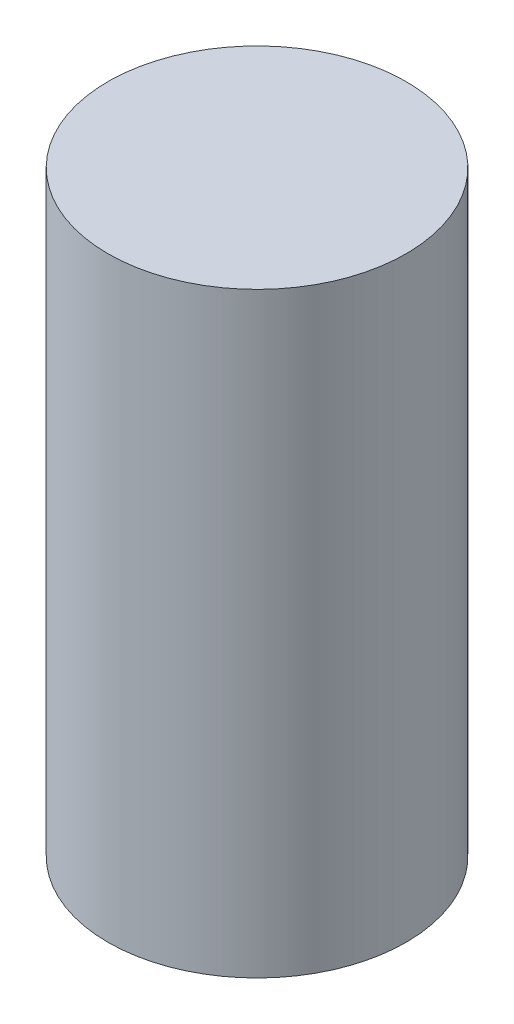
ISO-10303-21;
HEADER;
FILE_DESCRIPTION(('STEP AP214'),'2;1');
FILE_NAME('part.step','',(''),(''),'','','');
FILE_SCHEMA(('AUTOMOTIVE_DESIGN { 1 0 10303 214 1 1 1 1 }'));
ENDSEC;
DATA;
#1=APPLICATION_CONTEXT('core data for automotive mechanical design processes');
#2=APPLICATION_PROTOCOL_DEFINITION('international standard','automotive_design',2000,#1);
#3=PRODUCT_CONTEXT('',#1,'mechanical');
#4=PRODUCT('Part','Part','',(#3));
#5=PRODUCT_RELATED_PRODUCT_CATEGORY('part','',(#4));
#6=PRODUCT_DEFINITION_FORMATION('','',#4);
#7=PRODUCT_DEFINITION_CONTEXT('part definition',#1,'design');
#8=PRODUCT_DEFINITION('design','',#6,#7);
#9=PRODUCT_DEFINITION_SHAPE('','',#8);
#10=(LENGTH_UNIT() NAMED_UNIT(*) SI_UNIT(.MILLI.,.METRE.));
#11=(NAMED_UNIT(*) PLANE_ANGLE_UNIT() SI_UNIT($,.RADIAN.));
#12=(NAMED_UNIT(*) SI_UNIT($,.STERADIAN.) SOLID_ANGLE_UNIT());
#13=UNCERTAINTY_MEASURE_WITH_UNIT(LENGTH_MEASURE(1.E-05),#10,'distance_accuracy_value','');
#14=(GEOMETRIC_REPRESENTATION_CONTEXT(3) GLOBAL_UNCERTAINTY_ASSIGNED_CONTEXT((#13)) GLOBAL_UNIT_ASSIGNED_CONTEXT((#10,
#11,#12)) REPRESENTATION_CONTEXT('',''));
#15=CARTESIAN_POINT('',(0.,0.,0.));
#16=DIRECTION('',(0.,0.,1.));
#17=DIRECTION('',(1.,0.,0.));
#18=AXIS2_PLACEMENT_3D('',#15,#16,#17);
#19=CARTESIAN_POINT('',(0.,5.,0.));
#20=DIRECTION('',(0.,-1.,0.));
#21=DIRECTION('',(0.,0.,-1.));
#22=AXIS2_PLACEMENT_3D('',#19,#20,#21);
#23=CYLINDRICAL_SURFACE('',#22,1.25);
#24=CARTESIAN_POINT('',(0.,5.,0.));
#25=DIRECTION('',(0.,1.,0.));
#26=DIRECTION('',(0.,0.,1.));
#27=AXIS2_PLACEMENT_3D('',#24,#25,#26);
#28=CIRCLE('',#27,1.25);
#29=CARTESIAN_POINT('',(0.,5.,1.25));
#30=VERTEX_POINT('',#29);
#31=EDGE_CURVE('E10',#30,#30,#28,.T.);
#32=ORIENTED_EDGE('',*,*,#31,.F.);
#33=EDGE_LOOP('',(#32));
#34=FACE_BOUND('',#33,.T.);
#35=CARTESIAN_POINT('',(0.,0.,0.));
#36=DIRECTION('',(0.,1.,0.));
#37=DIRECTION('',(0.,0.,1.));
#38=AXIS2_PLACEMENT_3D('',#35,#36,#37);
#39=CIRCLE('',#38,1.25);
#40=CARTESIAN_POINT('',(0.,0.,1.25));
#41=VERTEX_POINT('',#40);
#42=EDGE_CURVE('E39',#41,#41,#39,.T.);
#43=ORIENTED_EDGE('',*,*,#42,.T.);
#44=EDGE_LOOP('',(#43));
#45=FACE_BOUND('',#44,.T.);
#46=ADVANCED_FACE('F36',(#34,#45),#23,.T.);
#47=CARTESIAN_POINT('',(0.,5.,0.));
#48=DIRECTION('',(0.,1.,0.));
#49=DIRECTION('',(0.,0.,1.));
#50=AXIS2_PLACEMENT_3D('',#47,#48,#49);
#51=PLANE('',#50);
#52=ORIENTED_EDGE('',*,*,#31,.T.);
#53=EDGE_LOOP('',(#52));
#54=FACE_BOUND('',#53,.T.);
#55=ADVANCED_FACE('F51',(#54),#51,.T.);
#56=CARTESIAN_POINT('',(0.,0.,0.));
#57=DIRECTION('',(0.,1.,0.));
#58=DIRECTION('',(0.,0.,1.));
#59=AXIS2_PLACEMENT_3D('',#56,#57,#58);
#60=PLANE('',#59);
#61=ORIENTED_EDGE('',*,*,#42,.F.);
#62=EDGE_LOOP('',(#61));
#63=FACE_BOUND('',#62,.T.);
#64=ADVANCED_FACE('F49',(#63),#60,.F.);
#65=CLOSED_SHELL('',(#46,#55,#64));
#66=MANIFOLD_SOLID_BREP('B2',#65);
#67=ADVANCED_BREP_SHAPE_REPRESENTATION('',(#18,#66),#14);
#68=SHAPE_DEFINITION_REPRESENTATION(#9,#67);
ENDSEC;
END-ISO-10303-21;
